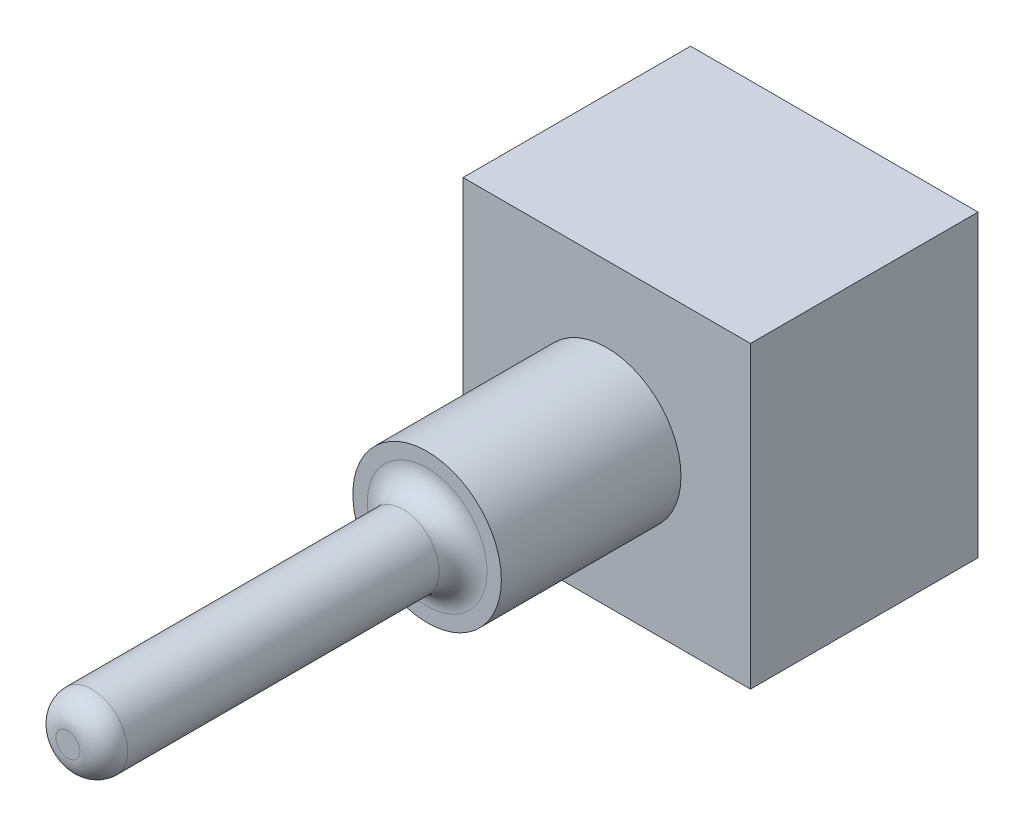
ISO-10303-21;
HEADER;
FILE_DESCRIPTION(('STEP AP214'),'2;1');
FILE_NAME('part.step','',(''),(''),'','','');
FILE_SCHEMA(('AUTOMOTIVE_DESIGN { 1 0 10303 214 1 1 1 1 }'));
ENDSEC;
DATA;
#1=APPLICATION_CONTEXT('core data for automotive mechanical design processes');
#2=APPLICATION_PROTOCOL_DEFINITION('international standard','automotive_design',2000,#1);
#3=PRODUCT_CONTEXT('',#1,'mechanical');
#4=PRODUCT('Part','Part','',(#3));
#5=PRODUCT_RELATED_PRODUCT_CATEGORY('part','',(#4));
#6=PRODUCT_DEFINITION_FORMATION('','',#4);
#7=PRODUCT_DEFINITION_CONTEXT('part definition',#1,'design');
#8=PRODUCT_DEFINITION('design','',#6,#7);
#9=PRODUCT_DEFINITION_SHAPE('','',#8);
#10=(LENGTH_UNIT() NAMED_UNIT(*) SI_UNIT(.MILLI.,.METRE.));
#11=(NAMED_UNIT(*) PLANE_ANGLE_UNIT() SI_UNIT($,.RADIAN.));
#12=(NAMED_UNIT(*) SI_UNIT($,.STERADIAN.) SOLID_ANGLE_UNIT());
#13=UNCERTAINTY_MEASURE_WITH_UNIT(LENGTH_MEASURE(1.E-05),#10,'distance_accuracy_value','');
#14=(GEOMETRIC_REPRESENTATION_CONTEXT(3) GLOBAL_UNCERTAINTY_ASSIGNED_CONTEXT((#13)) GLOBAL_UNIT_ASSIGNED_CONTEXT((#10,
#11,#12)) REPRESENTATION_CONTEXT('',''));
#15=CARTESIAN_POINT('',(0.,0.,0.));
#16=DIRECTION('',(0.,0.,1.));
#17=DIRECTION('',(1.,0.,0.));
#18=AXIS2_PLACEMENT_3D('',#15,#16,#17);
#19=CARTESIAN_POINT('',(-63.8068057080132,29.1818181818182,9.5));
#20=DIRECTION('',(1.,0.,0.));
#21=DIRECTION('',(0.,0.,-1.));
#22=AXIS2_PLACEMENT_3D('',#19,#20,#21);
#23=PLANE('',#22);
#24=DIRECTION('',(0.,-1.,0.));
#25=VECTOR('',#24,1.);
#26=CARTESIAN_POINT('',(-63.8068057080132,29.1818181818182,0.));
#27=LINE('',#26,#25);
#28=CARTESIAN_POINT('',(-63.8068057080132,29.1818181818182,0.));
#29=VERTEX_POINT('',#28);
#30=CARTESIAN_POINT('',(-63.8068057080132,16.6818181818182,0.));
#31=VERTEX_POINT('',#30);
#32=EDGE_CURVE('E102',#29,#31,#27,.T.);
#33=ORIENTED_EDGE('',*,*,#32,.T.);
#34=DIRECTION('',(0.,0.,-1.));
#35=VECTOR('',#34,1.);
#36=CARTESIAN_POINT('',(-63.8068057080132,16.6818181818182,9.5));
#37=LINE('',#36,#35);
#38=CARTESIAN_POINT('',(-63.8068057080132,16.6818181818182,9.5));
#39=VERTEX_POINT('',#38);
#40=EDGE_CURVE('E93',#39,#31,#37,.T.);
#41=ORIENTED_EDGE('',*,*,#40,.F.);
#42=DIRECTION('',(0.,-1.,0.));
#43=VECTOR('',#42,1.);
#44=CARTESIAN_POINT('',(-63.8068057080132,29.1818181818182,9.5));
#45=LINE('',#44,#43);
#46=CARTESIAN_POINT('',(-63.8068057080132,29.1818181818182,9.5));
#47=VERTEX_POINT('',#46);
#48=EDGE_CURVE('E87',#47,#39,#45,.T.);
#49=ORIENTED_EDGE('',*,*,#48,.F.);
#50=DIRECTION('',(0.,0.,-1.));
#51=VECTOR('',#50,1.);
#52=CARTESIAN_POINT('',(-63.8068057080132,29.1818181818182,9.5));
#53=LINE('',#52,#51);
#54=EDGE_CURVE('E98',#47,#29,#53,.T.);
#55=ORIENTED_EDGE('',*,*,#54,.T.);
#56=EDGE_LOOP('',(#33,#41,#49,#55));
#57=FACE_BOUND('',#56,.T.);
#58=ADVANCED_FACE('F34',(#57),#23,.F.);
#59=CARTESIAN_POINT('',(-63.8068057080132,16.6818181818182,9.5));
#60=DIRECTION('',(0.,1.,0.));
#61=DIRECTION('',(0.,0.,1.));
#62=AXIS2_PLACEMENT_3D('',#59,#60,#61);
#63=PLANE('',#62);
#64=DIRECTION('',(1.,0.,0.));
#65=VECTOR('',#64,1.);
#66=CARTESIAN_POINT('',(-63.8068057080132,16.6818181818182,0.));
#67=LINE('',#66,#65);
#68=CARTESIAN_POINT('',(-51.8068057080132,16.6818181818182,0.));
#69=VERTEX_POINT('',#68);
#70=EDGE_CURVE('E92',#31,#69,#67,.T.);
#71=ORIENTED_EDGE('',*,*,#70,.T.);
#72=DIRECTION('',(0.,0.,-1.));
#73=VECTOR('',#72,1.);
#74=CARTESIAN_POINT('',(-51.8068057080132,16.6818181818182,9.5));
#75=LINE('',#74,#73);
#76=CARTESIAN_POINT('',(-51.8068057080132,16.6818181818182,9.5));
#77=VERTEX_POINT('',#76);
#78=EDGE_CURVE('E90',#77,#69,#75,.T.);
#79=ORIENTED_EDGE('',*,*,#78,.F.);
#80=DIRECTION('',(1.,0.,0.));
#81=VECTOR('',#80,1.);
#82=CARTESIAN_POINT('',(-63.8068057080132,16.6818181818182,9.5));
#83=LINE('',#82,#81);
#84=EDGE_CURVE('E82',#39,#77,#83,.T.);
#85=ORIENTED_EDGE('',*,*,#84,.F.);
#86=ORIENTED_EDGE('',*,*,#40,.T.);
#87=EDGE_LOOP('',(#71,#79,#85,#86));
#88=FACE_BOUND('',#87,.T.);
#89=ADVANCED_FACE('F91',(#88),#63,.F.);
#90=CARTESIAN_POINT('',(-51.8068057080132,29.1818181818182,9.5));
#91=DIRECTION('',(-1.,0.,0.));
#92=DIRECTION('',(0.,0.,1.));
#93=AXIS2_PLACEMENT_3D('',#90,#91,#92);
#94=PLANE('',#93);
#95=DIRECTION('',(0.,1.,0.));
#96=VECTOR('',#95,1.);
#97=CARTESIAN_POINT('',(-51.8068057080132,29.1818181818182,0.));
#98=LINE('',#97,#96);
#99=CARTESIAN_POINT('',(-51.8068057080132,29.1818181818182,0.));
#100=VERTEX_POINT('',#99);
#101=EDGE_CURVE('E68',#69,#100,#98,.T.);
#102=ORIENTED_EDGE('',*,*,#101,.T.);
#103=DIRECTION('',(0.,0.,-1.));
#104=VECTOR('',#103,1.);
#105=CARTESIAN_POINT('',(-51.8068057080132,29.1818181818182,9.5));
#106=LINE('',#105,#104);
#107=CARTESIAN_POINT('',(-51.8068057080132,29.1818181818182,9.5));
#108=VERTEX_POINT('',#107);
#109=EDGE_CURVE('E94',#108,#100,#106,.T.);
#110=ORIENTED_EDGE('',*,*,#109,.F.);
#111=DIRECTION('',(0.,1.,0.));
#112=VECTOR('',#111,1.);
#113=CARTESIAN_POINT('',(-51.8068057080132,29.1818181818182,9.5));
#114=LINE('',#113,#112);
#115=EDGE_CURVE('E85',#77,#108,#114,.T.);
#116=ORIENTED_EDGE('',*,*,#115,.F.);
#117=ORIENTED_EDGE('',*,*,#78,.T.);
#118=EDGE_LOOP('',(#102,#110,#116,#117));
#119=FACE_BOUND('',#118,.T.);
#120=ADVANCED_FACE('F96',(#119),#94,.F.);
#121=CARTESIAN_POINT('',(-63.8068057080132,29.1818181818182,9.5));
#122=DIRECTION('',(0.,-1.,0.));
#123=DIRECTION('',(0.,0.,-1.));
#124=AXIS2_PLACEMENT_3D('',#121,#122,#123);
#125=PLANE('',#124);
#126=DIRECTION('',(-1.,0.,0.));
#127=VECTOR('',#126,1.);
#128=CARTESIAN_POINT('',(-63.8068057080132,29.1818181818182,0.));
#129=LINE('',#128,#127);
#130=EDGE_CURVE('E74',#100,#29,#129,.T.);
#131=ORIENTED_EDGE('',*,*,#130,.T.);
#132=ORIENTED_EDGE('',*,*,#54,.F.);
#133=DIRECTION('',(-1.,0.,0.));
#134=VECTOR('',#133,1.);
#135=CARTESIAN_POINT('',(-63.8068057080132,29.1818181818182,9.5));
#136=LINE('',#135,#134);
#137=EDGE_CURVE('E51',#108,#47,#136,.T.);
#138=ORIENTED_EDGE('',*,*,#137,.F.);
#139=ORIENTED_EDGE('',*,*,#109,.T.);
#140=EDGE_LOOP('',(#131,#132,#138,#139));
#141=FACE_BOUND('',#140,.T.);
#142=ADVANCED_FACE('F153',(#141),#125,.F.);
#143=CARTESIAN_POINT('',(0.,0.,9.5));
#144=DIRECTION('',(0.,0.,1.));
#145=DIRECTION('',(1.,0.,0.));
#146=AXIS2_PLACEMENT_3D('',#143,#144,#145);
#147=PLANE('',#146);
#148=CARTESIAN_POINT('',(-57.8068057080132,22.9318181818182,9.5));
#149=DIRECTION('',(0.,0.,1.));
#150=DIRECTION('',(1.,0.,0.));
#151=AXIS2_PLACEMENT_3D('',#148,#149,#150);
#152=CIRCLE('',#151,3.1);
#153=CARTESIAN_POINT('',(-54.7068057080132,22.9318181818182,9.5));
#154=VERTEX_POINT('',#153);
#155=EDGE_CURVE('E241',#154,#154,#152,.T.);
#156=ORIENTED_EDGE('',*,*,#155,.F.);
#157=EDGE_LOOP('',(#156));
#158=FACE_BOUND('',#157,.T.);
#159=ORIENTED_EDGE('',*,*,#48,.T.);
#160=ORIENTED_EDGE('',*,*,#84,.T.);
#161=ORIENTED_EDGE('',*,*,#115,.T.);
#162=ORIENTED_EDGE('',*,*,#137,.T.);
#163=EDGE_LOOP('',(#159,#160,#161,#162));
#164=FACE_BOUND('',#163,.T.);
#165=ADVANCED_FACE('F83',(#158,#164),#147,.T.);
#166=CARTESIAN_POINT('',(0.,0.,0.));
#167=DIRECTION('',(0.,0.,1.));
#168=DIRECTION('',(1.,0.,0.));
#169=AXIS2_PLACEMENT_3D('',#166,#167,#168);
#170=PLANE('',#169);
#171=ORIENTED_EDGE('',*,*,#32,.F.);
#172=ORIENTED_EDGE('',*,*,#130,.F.);
#173=ORIENTED_EDGE('',*,*,#101,.F.);
#174=ORIENTED_EDGE('',*,*,#70,.F.);
#175=EDGE_LOOP('',(#171,#172,#173,#174));
#176=FACE_BOUND('',#175,.T.);
#177=ADVANCED_FACE('F156',(#176),#170,.F.);
#178=CARTESIAN_POINT('',(-57.8068057080132,22.9318181818182,17.));
#179=DIRECTION('',(0.,0.,-1.));
#180=DIRECTION('',(-1.,0.,0.));
#181=AXIS2_PLACEMENT_3D('',#178,#179,#180);
#182=CYLINDRICAL_SURFACE('',#181,3.1);
#183=CARTESIAN_POINT('',(-57.8068057080132,22.9318181818182,17.));
#184=DIRECTION('',(0.,0.,1.));
#185=DIRECTION('',(1.,0.,0.));
#186=AXIS2_PLACEMENT_3D('',#183,#184,#185);
#187=CIRCLE('',#186,3.1);
#188=CARTESIAN_POINT('',(-54.7068057080132,22.9318181818182,17.));
#189=VERTEX_POINT('',#188);
#190=EDGE_CURVE('E105',#189,#189,#187,.T.);
#191=ORIENTED_EDGE('',*,*,#190,.F.);
#192=EDGE_LOOP('',(#191));
#193=FACE_BOUND('',#192,.T.);
#194=ORIENTED_EDGE('',*,*,#155,.T.);
#195=EDGE_LOOP('',(#194));
#196=FACE_BOUND('',#195,.T.);
#197=ADVANCED_FACE('F159',(#193,#196),#182,.T.);
#198=CARTESIAN_POINT('',(-57.8068057080132,22.9318181818182,17.));
#199=DIRECTION('',(0.,0.,1.));
#200=DIRECTION('',(1.,0.,0.));
#201=AXIS2_PLACEMENT_3D('',#198,#199,#200);
#202=PLANE('',#201);
#203=CARTESIAN_POINT('',(-57.8068057080132,22.9318181818182,17.));
#204=DIRECTION('',(0.,0.,1.));
#205=DIRECTION('',(1.,0.,0.));
#206=AXIS2_PLACEMENT_3D('',#203,#204,#205);
#207=CIRCLE('',#206,2.5);
#208=CARTESIAN_POINT('',(-55.3068057080132,22.9318181818182,17.));
#209=VERTEX_POINT('',#208);
#210=EDGE_CURVE('E43',#209,#209,#207,.F.);
#211=ORIENTED_EDGE('',*,*,#210,.T.);
#212=EDGE_LOOP('',(#211));
#213=FACE_BOUND('',#212,.T.);
#214=ORIENTED_EDGE('',*,*,#190,.T.);
#215=EDGE_LOOP('',(#214));
#216=FACE_BOUND('',#215,.T.);
#217=ADVANCED_FACE('F120',(#213,#216),#202,.T.);
#218=CARTESIAN_POINT('',(-57.8068057080132,22.9318181818182,32.));
#219=DIRECTION('',(0.,0.,-1.));
#220=DIRECTION('',(-1.,0.,0.));
#221=AXIS2_PLACEMENT_3D('',#218,#219,#220);
#222=CYLINDRICAL_SURFACE('',#221,1.5);
#223=CARTESIAN_POINT('',(-57.8068057080132,22.9318181818182,18.));
#224=DIRECTION('',(0.,0.,1.));
#225=DIRECTION('',(1.,0.,0.));
#226=AXIS2_PLACEMENT_3D('',#223,#224,#225);
#227=CIRCLE('',#226,1.5);
#228=CARTESIAN_POINT('',(-56.3068057080132,22.9318181818182,18.));
#229=VERTEX_POINT('',#228);
#230=EDGE_CURVE('E115',#229,#229,#227,.T.);
#231=ORIENTED_EDGE('',*,*,#230,.T.);
#232=EDGE_LOOP('',(#231));
#233=FACE_BOUND('',#232,.T.);
#234=CARTESIAN_POINT('',(-57.8068057080132,22.9318181818182,31.));
#235=DIRECTION('',(0.,0.,1.));
#236=DIRECTION('',(1.,0.,0.));
#237=AXIS2_PLACEMENT_3D('',#234,#235,#236);
#238=CIRCLE('',#237,1.5);
#239=CARTESIAN_POINT('',(-56.3068057080132,22.9318181818182,31.));
#240=VERTEX_POINT('',#239);
#241=EDGE_CURVE('E112',#240,#240,#238,.F.);
#242=ORIENTED_EDGE('',*,*,#241,.T.);
#243=EDGE_LOOP('',(#242));
#244=FACE_BOUND('',#243,.T.);
#245=ADVANCED_FACE('F129',(#233,#244),#222,.T.);
#246=CARTESIAN_POINT('',(-57.8068057080132,22.9318181818182,32.));
#247=DIRECTION('',(0.,0.,1.));
#248=DIRECTION('',(1.,0.,0.));
#249=AXIS2_PLACEMENT_3D('',#246,#247,#248);
#250=PLANE('',#249);
#251=CARTESIAN_POINT('',(-57.8068057080132,22.9318181818182,32.));
#252=DIRECTION('',(0.,0.,1.));
#253=DIRECTION('',(1.,0.,0.));
#254=AXIS2_PLACEMENT_3D('',#251,#252,#253);
#255=CIRCLE('',#254,0.500000000000004);
#256=CARTESIAN_POINT('',(-57.3068057080132,22.9318181818182,32.));
#257=VERTEX_POINT('',#256);
#258=EDGE_CURVE('E11',#257,#257,#255,.T.);
#259=ORIENTED_EDGE('',*,*,#258,.T.);
#260=EDGE_LOOP('',(#259));
#261=FACE_BOUND('',#260,.T.);
#262=ADVANCED_FACE('F126',(#261),#250,.T.);
#263=CARTESIAN_POINT('',(-57.8068057080132,22.9318181818182,18.));
#264=DIRECTION('',(0.,0.,1.));
#265=DIRECTION('',(1.,0.,0.));
#266=AXIS2_PLACEMENT_3D('',#263,#264,#265);
#267=TOROIDAL_SURFACE('',#266,2.5,1.);
#268=ORIENTED_EDGE('',*,*,#210,.F.);
#269=EDGE_LOOP('',(#268));
#270=FACE_BOUND('',#269,.T.);
#271=ORIENTED_EDGE('',*,*,#230,.F.);
#272=EDGE_LOOP('',(#271));
#273=FACE_BOUND('',#272,.T.);
#274=ADVANCED_FACE('F123',(#270,#273),#267,.F.);
#275=CARTESIAN_POINT('',(-57.8068057080132,22.9318181818182,31.));
#276=DIRECTION('',(0.,0.,1.));
#277=DIRECTION('',(1.,0.,0.));
#278=AXIS2_PLACEMENT_3D('',#275,#276,#277);
#279=DEGENERATE_TOROIDAL_SURFACE('',#278,0.500000000000004,1.,.T.);
#280=ORIENTED_EDGE('',*,*,#241,.F.);
#281=EDGE_LOOP('',(#280));
#282=FACE_BOUND('',#281,.T.);
#283=ORIENTED_EDGE('',*,*,#258,.F.);
#284=EDGE_LOOP('',(#283));
#285=FACE_BOUND('',#284,.T.);
#286=ADVANCED_FACE('F36',(#282,#285),#279,.T.);
#287=CLOSED_SHELL('',(#58,#89,#120,#142,#165,#177,#197,#217,#245,#262,#274,#286));
#288=MANIFOLD_SOLID_BREP('B2',#287);
#289=ADVANCED_BREP_SHAPE_REPRESENTATION('',(#18,#288),#14);
#290=SHAPE_DEFINITION_REPRESENTATION(#9,#289);
ENDSEC;
END-ISO-10303-21;
